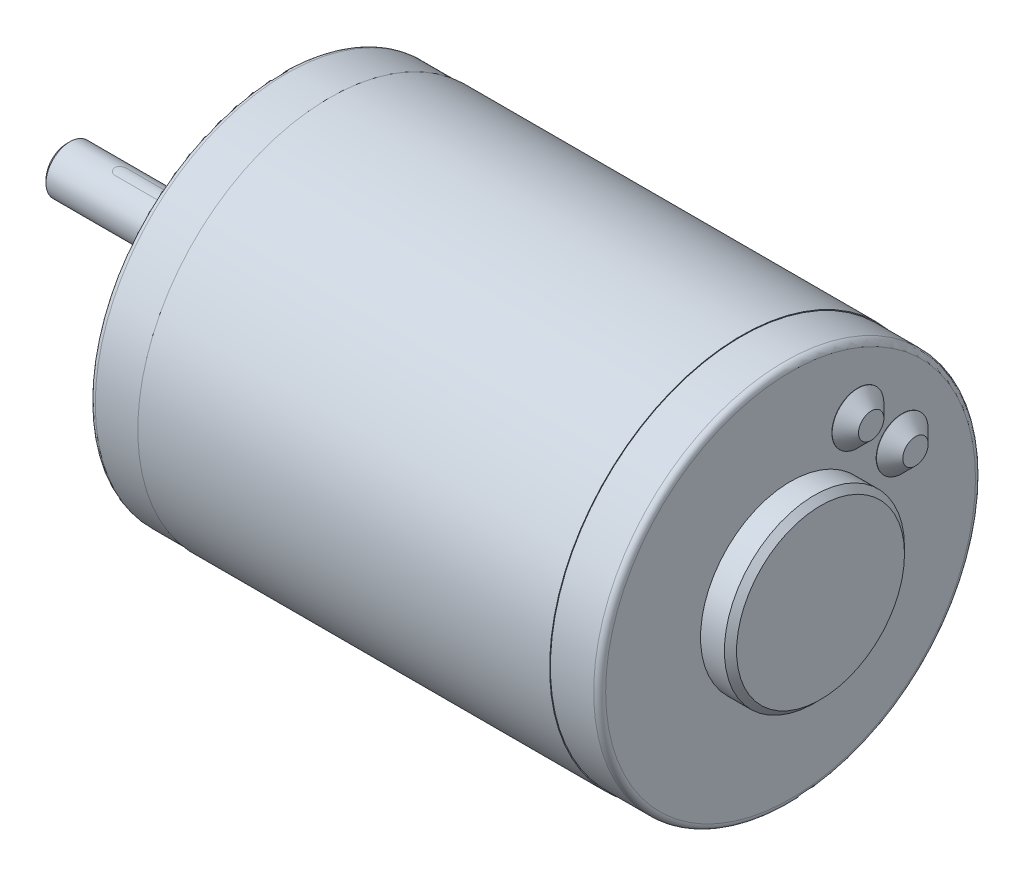
ISO-10303-21;
HEADER;
FILE_DESCRIPTION(('STEP AP214'),'2;1');
FILE_NAME('part.step','',(''),(''),'','','');
FILE_SCHEMA(('AUTOMOTIVE_DESIGN { 1 0 10303 214 1 1 1 1 }'));
ENDSEC;
DATA;
#1=APPLICATION_CONTEXT('core data for automotive mechanical design processes');
#2=APPLICATION_PROTOCOL_DEFINITION('international standard','automotive_design',2000,#1);
#3=PRODUCT_CONTEXT('',#1,'mechanical');
#4=PRODUCT('Part','Part','',(#3));
#5=PRODUCT_RELATED_PRODUCT_CATEGORY('part','',(#4));
#6=PRODUCT_DEFINITION_FORMATION('','',#4);
#7=PRODUCT_DEFINITION_CONTEXT('part definition',#1,'design');
#8=PRODUCT_DEFINITION('design','',#6,#7);
#9=PRODUCT_DEFINITION_SHAPE('','',#8);
#10=(LENGTH_UNIT() NAMED_UNIT(*) SI_UNIT(.MILLI.,.METRE.));
#11=(NAMED_UNIT(*) PLANE_ANGLE_UNIT() SI_UNIT($,.RADIAN.));
#12=(NAMED_UNIT(*) SI_UNIT($,.STERADIAN.) SOLID_ANGLE_UNIT());
#13=UNCERTAINTY_MEASURE_WITH_UNIT(LENGTH_MEASURE(1.E-05),#10,'distance_accuracy_value','');
#14=(GEOMETRIC_REPRESENTATION_CONTEXT(3) GLOBAL_UNCERTAINTY_ASSIGNED_CONTEXT((#13)) GLOBAL_UNIT_ASSIGNED_CONTEXT((#10,
#11,#12)) REPRESENTATION_CONTEXT('',''));
#15=CARTESIAN_POINT('',(0.,0.,0.));
#16=DIRECTION('',(0.,0.,1.));
#17=DIRECTION('',(1.,0.,0.));
#18=AXIS2_PLACEMENT_3D('',#15,#16,#17);
#19=CARTESIAN_POINT('',(-4.,0.,0.));
#20=DIRECTION('',(-1.,0.,0.));
#21=DIRECTION('',(0.,0.,1.));
#22=AXIS2_PLACEMENT_3D('',#19,#20,#21);
#23=PLANE('',#22);
#24=CARTESIAN_POINT('',(-4.,0.,0.));
#25=DIRECTION('',(-1.,0.,0.));
#26=DIRECTION('',(0.,0.,1.));
#27=AXIS2_PLACEMENT_3D('',#24,#25,#26);
#28=CIRCLE('',#27,8.50900000000003);
#29=CARTESIAN_POINT('',(-4.,0.,8.50900000000003));
#30=VERTEX_POINT('',#29);
#31=EDGE_CURVE('P0_E190',#30,#30,#28,.T.);
#32=ORIENTED_EDGE('',*,*,#31,.T.);
#33=EDGE_LOOP('',(#32));
#34=FACE_BOUND('',#33,.T.);
#35=CARTESIAN_POINT('',(-4.,0.,0.));
#36=DIRECTION('',(-1.,0.,0.));
#37=DIRECTION('',(0.,0.,1.));
#38=AXIS2_PLACEMENT_3D('',#35,#36,#37);
#39=CIRCLE('',#38,4.);
#40=CARTESIAN_POINT('',(-4.,0.,4.));
#41=VERTEX_POINT('',#40);
#42=EDGE_CURVE('P0_E122',#41,#41,#39,.T.);
#43=ORIENTED_EDGE('',*,*,#42,.F.);
#44=EDGE_LOOP('',(#43));
#45=FACE_BOUND('',#44,.T.);
#46=ADVANCED_FACE('P0_F39',(#34,#45),#23,.T.);
#47=CARTESIAN_POINT('',(0.,0.,0.));
#48=DIRECTION('',(-1.,0.,0.));
#49=DIRECTION('',(0.,0.,1.));
#50=AXIS2_PLACEMENT_3D('',#47,#48,#49);
#51=PLANE('',#50);
#52=CARTESIAN_POINT('',(0.,0.,0.));
#53=DIRECTION('',(-1.,0.,0.));
#54=DIRECTION('',(0.,0.,1.));
#55=AXIS2_PLACEMENT_3D('',#52,#53,#54);
#56=CIRCLE('',#55,30.877);
#57=CARTESIAN_POINT('',(0.,0.,30.877));
#58=VERTEX_POINT('',#57);
#59=EDGE_CURVE('P0_E208',#58,#58,#56,.T.);
#60=ORIENTED_EDGE('',*,*,#59,.T.);
#61=EDGE_LOOP('',(#60));
#62=FACE_BOUND('',#61,.T.);
#63=CARTESIAN_POINT('',(0.,25.4,0.));
#64=DIRECTION('',(-1.,0.,0.));
#65=DIRECTION('',(0.,0.,1.));
#66=AXIS2_PLACEMENT_3D('',#63,#64,#65);
#67=CIRCLE('',#66,2.01929999999999);
#68=CARTESIAN_POINT('',(0.,25.4,2.01929999999999));
#69=VERTEX_POINT('',#68);
#70=EDGE_CURVE('P0_E96',#69,#69,#67,.T.);
#71=ORIENTED_EDGE('',*,*,#70,.F.);
#72=EDGE_LOOP('',(#71));
#73=FACE_BOUND('',#72,.T.);
#74=CARTESIAN_POINT('',(0.,-25.4,0.));
#75=DIRECTION('',(-1.,0.,0.));
#76=DIRECTION('',(0.,0.,1.));
#77=AXIS2_PLACEMENT_3D('',#74,#75,#76);
#78=CIRCLE('',#77,2.01929999999999);
#79=CARTESIAN_POINT('',(0.,-25.4,2.01929999999999));
#80=VERTEX_POINT('',#79);
#81=EDGE_CURVE('P0_E95',#80,#80,#78,.T.);
#82=ORIENTED_EDGE('',*,*,#81,.F.);
#83=EDGE_LOOP('',(#82));
#84=FACE_BOUND('',#83,.T.);
#85=CARTESIAN_POINT('',(0.,0.,0.));
#86=DIRECTION('',(-1.,0.,0.));
#87=DIRECTION('',(0.,0.,1.));
#88=AXIS2_PLACEMENT_3D('',#85,#86,#87);
#89=CIRCLE('',#88,9.525);
#90=CARTESIAN_POINT('',(0.,0.,9.525));
#91=VERTEX_POINT('',#90);
#92=EDGE_CURVE('P0_E166',#91,#91,#89,.T.);
#93=ORIENTED_EDGE('',*,*,#92,.F.);
#94=EDGE_LOOP('',(#93));
#95=FACE_BOUND('',#94,.T.);
#96=ADVANCED_FACE('P0_F229',(#62,#73,#84,#95),#51,.T.);
#97=CARTESIAN_POINT('',(8.2296,32.004,0.));
#98=DIRECTION('',(-1.,0.,0.));
#99=DIRECTION('',(0.,0.,1.));
#100=AXIS2_PLACEMENT_3D('',#97,#98,#99);
#101=PLANE('',#100);
#102=CARTESIAN_POINT('',(8.2296,0.,0.));
#103=DIRECTION('',(1.,0.,0.));
#104=DIRECTION('',(0.,0.,-1.));
#105=AXIS2_PLACEMENT_3D('',#102,#103,#104);
#106=CIRCLE('',#105,32.004);
#107=CARTESIAN_POINT('',(8.2296,0.,-32.004));
#108=VERTEX_POINT('',#107);
#109=EDGE_CURVE('P0_E181',#108,#108,#106,.T.);
#110=ORIENTED_EDGE('',*,*,#109,.F.);
#111=EDGE_LOOP('',(#110));
#112=FACE_BOUND('',#111,.T.);
#113=CARTESIAN_POINT('',(8.2296,0.,0.));
#114=DIRECTION('',(-1.,0.,0.));
#115=DIRECTION('',(0.,0.,1.));
#116=AXIS2_PLACEMENT_3D('',#113,#114,#115);
#117=CIRCLE('',#116,31.877);
#118=CARTESIAN_POINT('',(8.2296,0.,31.877));
#119=VERTEX_POINT('',#118);
#120=EDGE_CURVE('P0_E169',#119,#119,#117,.T.);
#121=ORIENTED_EDGE('',*,*,#120,.F.);
#122=EDGE_LOOP('',(#121));
#123=FACE_BOUND('',#122,.T.);
#124=ADVANCED_FACE('P0_F235',(#112,#123),#101,.T.);
#125=CARTESIAN_POINT('',(85.216,0.,0.));
#126=DIRECTION('',(1.,0.,0.));
#127=DIRECTION('',(0.,0.,-1.));
#128=AXIS2_PLACEMENT_3D('',#125,#126,#127);
#129=PLANE('',#128);
#130=CARTESIAN_POINT('',(85.216,0.,0.));
#131=DIRECTION('',(1.,0.,0.));
#132=DIRECTION('',(0.,0.,-1.));
#133=AXIS2_PLACEMENT_3D('',#130,#131,#132);
#134=CIRCLE('',#133,30.877);
#135=CARTESIAN_POINT('',(85.216,0.,-30.877));
#136=VERTEX_POINT('',#135);
#137=EDGE_CURVE('P0_E47',#136,#136,#134,.T.);
#138=ORIENTED_EDGE('',*,*,#137,.T.);
#139=EDGE_LOOP('',(#138));
#140=FACE_BOUND('',#139,.T.);
#141=CARTESIAN_POINT('',(85.216,18.6070906828553,-11.2073596390943));
#142=DIRECTION('',(1.,0.,0.));
#143=DIRECTION('',(0.,0.,-1.));
#144=AXIS2_PLACEMENT_3D('',#141,#142,#143);
#145=CIRCLE('',#144,4.318);
#146=CARTESIAN_POINT('',(85.216,18.6070906828553,-15.5253596390943));
#147=VERTEX_POINT('',#146);
#148=EDGE_CURVE('P0_E187',#147,#147,#145,.T.);
#149=ORIENTED_EDGE('',*,*,#148,.F.);
#150=EDGE_LOOP('',(#149));
#151=FACE_BOUND('',#150,.T.);
#152=CARTESIAN_POINT('',(85.216,11.2073596390943,-18.6070906828553));
#153=DIRECTION('',(1.,0.,0.));
#154=DIRECTION('',(0.,0.,-1.));
#155=AXIS2_PLACEMENT_3D('',#152,#153,#154);
#156=CIRCLE('',#155,4.318);
#157=CARTESIAN_POINT('',(85.216,11.2073596390943,-22.9250906828553));
#158=VERTEX_POINT('',#157);
#159=EDGE_CURVE('P0_E184',#158,#158,#156,.T.);
#160=ORIENTED_EDGE('',*,*,#159,.F.);
#161=EDGE_LOOP('',(#160));
#162=FACE_BOUND('',#161,.T.);
#163=CARTESIAN_POINT('',(85.216,0.,0.));
#164=DIRECTION('',(1.,0.,0.));
#165=DIRECTION('',(0.,0.,-1.));
#166=AXIS2_PLACEMENT_3D('',#163,#164,#165);
#167=CIRCLE('',#166,15.0368);
#168=CARTESIAN_POINT('',(85.216,0.,-15.0368));
#169=VERTEX_POINT('',#168);
#170=EDGE_CURVE('P0_E172',#169,#169,#167,.T.);
#171=ORIENTED_EDGE('',*,*,#170,.F.);
#172=EDGE_LOOP('',(#171));
#173=FACE_BOUND('',#172,.T.);
#174=ADVANCED_FACE('P0_F216',(#140,#151,#162,#173),#129,.T.);
#175=CARTESIAN_POINT('',(76.9864,0.,0.));
#176=DIRECTION('',(1.,0.,0.));
#177=DIRECTION('',(0.,0.,-1.));
#178=AXIS2_PLACEMENT_3D('',#175,#176,#177);
#179=PLANE('',#178);
#180=CARTESIAN_POINT('',(76.9864,0.,0.));
#181=DIRECTION('',(1.,0.,0.));
#182=DIRECTION('',(0.,0.,-1.));
#183=AXIS2_PLACEMENT_3D('',#180,#181,#182);
#184=CIRCLE('',#183,32.004);
#185=CARTESIAN_POINT('',(76.9864,0.,-32.004));
#186=VERTEX_POINT('',#185);
#187=EDGE_CURVE('P0_E178',#186,#186,#184,.T.);
#188=ORIENTED_EDGE('',*,*,#187,.T.);
#189=EDGE_LOOP('',(#188));
#190=FACE_BOUND('',#189,.T.);
#191=CARTESIAN_POINT('',(76.9864,0.,0.));
#192=DIRECTION('',(1.,0.,0.));
#193=DIRECTION('',(0.,0.,-1.));
#194=AXIS2_PLACEMENT_3D('',#191,#192,#193);
#195=CIRCLE('',#194,31.877);
#196=CARTESIAN_POINT('',(76.9864,0.,-31.877));
#197=VERTEX_POINT('',#196);
#198=EDGE_CURVE('P0_E175',#197,#197,#195,.T.);
#199=ORIENTED_EDGE('',*,*,#198,.F.);
#200=EDGE_LOOP('',(#199));
#201=FACE_BOUND('',#200,.T.);
#202=ADVANCED_FACE('P0_F262',(#190,#201),#179,.T.);
#203=CARTESIAN_POINT('',(8.2296,0.,0.));
#204=DIRECTION('',(1.,0.,0.));
#205=DIRECTION('',(0.,0.,-1.));
#206=AXIS2_PLACEMENT_3D('',#203,#204,#205);
#207=CYLINDRICAL_SURFACE('',#206,32.004);
#208=ORIENTED_EDGE('',*,*,#109,.T.);
#209=EDGE_LOOP('',(#208));
#210=FACE_BOUND('',#209,.T.);
#211=ORIENTED_EDGE('',*,*,#187,.F.);
#212=EDGE_LOOP('',(#211));
#213=FACE_BOUND('',#212,.T.);
#214=ADVANCED_FACE('P0_F265',(#210,#213),#207,.T.);
#215=CARTESIAN_POINT('',(85.216,0.,0.));
#216=DIRECTION('',(-1.,0.,0.));
#217=DIRECTION('',(0.,0.,1.));
#218=AXIS2_PLACEMENT_3D('',#215,#216,#217);
#219=CYLINDRICAL_SURFACE('',#218,31.877);
#220=CARTESIAN_POINT('',(84.216,0.,0.));
#221=DIRECTION('',(1.,0.,0.));
#222=DIRECTION('',(0.,0.,-1.));
#223=AXIS2_PLACEMENT_3D('',#220,#221,#222);
#224=CIRCLE('',#223,31.877);
#225=CARTESIAN_POINT('',(84.216,0.,-31.877));
#226=VERTEX_POINT('',#225);
#227=EDGE_CURVE('P0_E11',#226,#226,#224,.F.);
#228=ORIENTED_EDGE('',*,*,#227,.T.);
#229=EDGE_LOOP('',(#228));
#230=FACE_BOUND('',#229,.T.);
#231=ORIENTED_EDGE('',*,*,#198,.T.);
#232=EDGE_LOOP('',(#231));
#233=FACE_BOUND('',#232,.T.);
#234=ADVANCED_FACE('P0_F258',(#230,#233),#219,.T.);
#235=CARTESIAN_POINT('',(90.216,0.,0.));
#236=DIRECTION('',(-1.,0.,0.));
#237=DIRECTION('',(0.,0.,1.));
#238=AXIS2_PLACEMENT_3D('',#235,#236,#237);
#239=CYLINDRICAL_SURFACE('',#238,15.0368);
#240=CARTESIAN_POINT('',(89.2,0.,0.));
#241=DIRECTION('',(1.,0.,0.));
#242=DIRECTION('',(0.,0.,-1.));
#243=AXIS2_PLACEMENT_3D('',#240,#241,#242);
#244=CIRCLE('',#243,15.0368);
#245=CARTESIAN_POINT('',(89.2,0.,-15.0368));
#246=VERTEX_POINT('',#245);
#247=EDGE_CURVE('P0_E199',#246,#246,#244,.F.);
#248=ORIENTED_EDGE('',*,*,#247,.T.);
#249=EDGE_LOOP('',(#248));
#250=FACE_BOUND('',#249,.T.);
#251=ORIENTED_EDGE('',*,*,#170,.T.);
#252=EDGE_LOOP('',(#251));
#253=FACE_BOUND('',#252,.T.);
#254=ADVANCED_FACE('P0_F254',(#250,#253),#239,.T.);
#255=CARTESIAN_POINT('',(90.216,0.,0.));
#256=DIRECTION('',(1.,0.,0.));
#257=DIRECTION('',(0.,0.,-1.));
#258=AXIS2_PLACEMENT_3D('',#255,#256,#257);
#259=PLANE('',#258);
#260=CARTESIAN_POINT('',(90.216,0.,0.));
#261=DIRECTION('',(1.,0.,0.));
#262=DIRECTION('',(0.,0.,-1.));
#263=AXIS2_PLACEMENT_3D('',#260,#261,#262);
#264=CIRCLE('',#263,14.0208);
#265=CARTESIAN_POINT('',(90.216,0.,-14.0208));
#266=VERTEX_POINT('',#265);
#267=EDGE_CURVE('P0_E196',#266,#266,#264,.T.);
#268=ORIENTED_EDGE('',*,*,#267,.T.);
#269=EDGE_LOOP('',(#268));
#270=FACE_BOUND('',#269,.T.);
#271=ADVANCED_FACE('P0_F250',(#270),#259,.T.);
#272=CARTESIAN_POINT('',(0.,0.,0.));
#273=DIRECTION('',(1.,0.,0.));
#274=DIRECTION('',(0.,0.,-1.));
#275=AXIS2_PLACEMENT_3D('',#272,#273,#274);
#276=CYLINDRICAL_SURFACE('',#275,31.877);
#277=CARTESIAN_POINT('',(0.999999999999997,0.,0.));
#278=DIRECTION('',(-1.,0.,0.));
#279=DIRECTION('',(0.,0.,1.));
#280=AXIS2_PLACEMENT_3D('',#277,#278,#279);
#281=CIRCLE('',#280,31.877);
#282=CARTESIAN_POINT('',(0.999999999999997,0.,31.877));
#283=VERTEX_POINT('',#282);
#284=EDGE_CURVE('P0_E211',#283,#283,#281,.F.);
#285=ORIENTED_EDGE('',*,*,#284,.T.);
#286=EDGE_LOOP('',(#285));
#287=FACE_BOUND('',#286,.T.);
#288=ORIENTED_EDGE('',*,*,#120,.T.);
#289=EDGE_LOOP('',(#288));
#290=FACE_BOUND('',#289,.T.);
#291=ADVANCED_FACE('P0_F245',(#287,#290),#276,.T.);
#292=CARTESIAN_POINT('',(-4.,0.,0.));
#293=DIRECTION('',(1.,0.,0.));
#294=DIRECTION('',(0.,0.,-1.));
#295=AXIS2_PLACEMENT_3D('',#292,#293,#294);
#296=CYLINDRICAL_SURFACE('',#295,9.525);
#297=CARTESIAN_POINT('',(-2.98400000000003,0.,0.));
#298=DIRECTION('',(-1.,0.,0.));
#299=DIRECTION('',(0.,0.,1.));
#300=AXIS2_PLACEMENT_3D('',#297,#298,#299);
#301=CIRCLE('',#300,9.525);
#302=CARTESIAN_POINT('',(-2.98400000000003,0.,9.525));
#303=VERTEX_POINT('',#302);
#304=EDGE_CURVE('P0_E193',#303,#303,#301,.F.);
#305=ORIENTED_EDGE('',*,*,#304,.T.);
#306=EDGE_LOOP('',(#305));
#307=FACE_BOUND('',#306,.T.);
#308=ORIENTED_EDGE('',*,*,#92,.T.);
#309=EDGE_LOOP('',(#308));
#310=FACE_BOUND('',#309,.T.);
#311=ADVANCED_FACE('P0_F243',(#307,#310),#296,.T.);
#312=CARTESIAN_POINT('',(-35.6,0.,0.));
#313=DIRECTION('',(1.,0.,0.));
#314=DIRECTION('',(0.,0.,-1.));
#315=AXIS2_PLACEMENT_3D('',#312,#313,#314);
#316=CYLINDRICAL_SURFACE('',#315,4.);
#317=CARTESIAN_POINT('',(-35.0999999999929,0.,0.));
#318=DIRECTION('',(-1.,0.,0.));
#319=DIRECTION('',(0.,0.,1.));
#320=AXIS2_PLACEMENT_3D('',#317,#318,#319);
#321=CIRCLE('',#320,4.);
#322=CARTESIAN_POINT('',(-35.0999999999929,0.,4.));
#323=VERTEX_POINT('',#322);
#324=EDGE_CURVE('P0_E205',#323,#323,#321,.F.);
#325=ORIENTED_EDGE('',*,*,#324,.T.);
#326=EDGE_LOOP('',(#325));
#327=FACE_BOUND('',#326,.T.);
#328=DIRECTION('',(1.,0.,0.));
#329=VECTOR('',#328,1.);
#330=CARTESIAN_POINT('',(0.,3.87298334620741,-1.));
#331=LINE('',#330,#329);
#332=CARTESIAN_POINT('',(-26.6,3.87298334620741,-1.));
#333=VERTEX_POINT('',#332);
#334=CARTESIAN_POINT('',(-7.1,3.87298334620741,-1.));
#335=VERTEX_POINT('',#334);
#336=EDGE_CURVE('P0_E141',#333,#335,#331,.T.);
#337=ORIENTED_EDGE('',*,*,#336,.T.);
#338=CARTESIAN_POINT('',(-7.1,3.87298334620741,-1.));
#339=CARTESIAN_POINT('',(-7.07233701489346,3.87298148580177,-1.00000033749611));
#340=CARTESIAN_POINT('',(-7.04468773698177,3.8732800994947,-0.998851407375366));
#341=CARTESIAN_POINT('',(-6.98959596469644,3.87445904774558,-0.994271295395754));
#342=CARTESIAN_POINT('',(-6.96215343631291,3.87533928441687,-0.990840497572679));
#343=CARTESIAN_POINT('',(-6.88054682679116,3.87881710972053,-0.977175239382526));
#344=CARTESIAN_POINT('',(-6.82694353151779,3.88225203148808,-0.963567695172493));
#345=CARTESIAN_POINT('',(-6.72287532621804,3.89095422588002,-0.927798076247997));
#346=CARTESIAN_POINT('',(-6.67241012178714,3.89622132630929,-0.905636805423836));
#347=CARTESIAN_POINT('',(-6.57588855135267,3.90799134471939,-0.853415378025865));
#348=CARTESIAN_POINT('',(-6.52983337210904,3.91449459395647,-0.823353103356933));
#349=CARTESIAN_POINT('',(-6.4424561180939,3.92816262398025,-0.755484471828069));
#350=CARTESIAN_POINT('',(-6.40124511375448,3.93533791028915,-0.717537268783976));
#351=CARTESIAN_POINT('',(-6.32569791051729,3.94945104396193,-0.63527578051623));
#352=CARTESIAN_POINT('',(-6.29136281053206,3.95638885322537,-0.590960479478831));
#353=CARTESIAN_POINT('',(-6.23008899838136,3.96936182283248,-0.496456899401691));
#354=CARTESIAN_POINT('',(-6.20326010401603,3.9753830468173,-0.446195340334474));
#355=CARTESIAN_POINT('',(-6.1584752658033,3.98572346250588,-0.341702590842919));
#356=CARTESIAN_POINT('',(-6.14051757570017,3.990042989147,-0.28747218408301));
#357=CARTESIAN_POINT('',(-6.11434100722257,3.99641900005128,-0.17774410852516));
#358=CARTESIAN_POINT('',(-6.10593232757718,3.998519529013,-0.122294322002858));
#359=CARTESIAN_POINT('',(-6.09849662845671,4.00037438150815,-0.0107327756816796));
#360=CARTESIAN_POINT('',(-6.09946842980766,4.00012899993444,0.0453789000287057));
#361=CARTESIAN_POINT('',(-6.11062996368545,3.99735237365735,0.155352492972096));
#362=CARTESIAN_POINT('',(-6.12061461659948,3.9948719867736,0.209236701739855));
#363=CARTESIAN_POINT('',(-6.14918867918275,3.98796330636495,0.31453871108434));
#364=CARTESIAN_POINT('',(-6.16777846956858,3.98353492665556,0.365956402423988));
#365=CARTESIAN_POINT('',(-6.21320128067065,3.97314997761798,0.465407286024539));
#366=CARTESIAN_POINT('',(-6.24010739423284,3.96717993827555,0.513405629602248));
#367=CARTESIAN_POINT('',(-6.30134312983347,3.95435945541919,0.604276631230014));
#368=CARTESIAN_POINT('',(-6.33567387025322,3.94750887933198,0.647148515562289));
#369=CARTESIAN_POINT('',(-6.41187891208131,3.93345566022865,0.72776938970849));
#370=CARTESIAN_POINT('',(-6.45393163653981,3.92624850477685,0.765349103054127));
#371=CARTESIAN_POINT('',(-6.54382986692773,3.91246168284006,0.832969575186237));
#372=CARTESIAN_POINT('',(-6.59167695328356,3.90588218842993,0.863008270245062));
#373=CARTESIAN_POINT('',(-6.69214559782377,3.89407813586325,0.914804709285962));
#374=CARTESIAN_POINT('',(-6.74479146489609,3.88886106009136,0.936517017887269));
#375=CARTESIAN_POINT('',(-6.85311692841829,3.88047058807055,0.970702351849829));
#376=CARTESIAN_POINT('',(-6.90879185514984,3.87729413761435,0.983189189212132));
#377=CARTESIAN_POINT('',(-6.9874573807589,3.87455290681524,0.993904635150938));
#378=CARTESIAN_POINT('',(-7.00991970321318,3.87396523110859,0.996190790966708));
#379=CARTESIAN_POINT('',(-7.05491778990932,3.87318062488974,0.999236757697394));
#380=CARTESIAN_POINT('',(-7.07745337595529,3.87298306219461,0.999999038096045));
#381=CARTESIAN_POINT('',(-7.1,3.87298334620741,1.));
#382=B_SPLINE_CURVE_WITH_KNOTS('',3,(#338,#339,#340,#341,#342,#343,#344,#345,#346,#347,#348,
#349,#350,#351,#352,#353,#354,#355,#356,#357,#358,#359,#360,#361,#362,#363,#364,#365,#366,#367,
#368,#369,#370,#371,#372,#373,#374,#375,#376,#377,#378,#379,#380,#381),.UNSPECIFIED.,.F.,.F.,(4,
2,2,2,2,2,2,2,2,2,2,2,2,2,2,2,2,2,2,2,2,4),(0.,0.0829365303397693,0.165859106084651,
0.331229963080317,0.496585282091498,0.661984974726749,0.830641897427974,0.999325753539193,
1.17036187098235,1.34136430732424,1.50890481515325,1.67642426256639,1.84022545479276,
2.00403389475838,2.16932509450376,2.33464120964329,2.50441429534542,2.67423379180967,
2.84496720161068,3.01544447539986,3.08315848722648,3.15076267731671),.UNSPECIFIED.);
#383=CARTESIAN_POINT('',(-7.1,3.87298334620741,1.));
#384=VERTEX_POINT('',#383);
#385=EDGE_CURVE('P0_E118',#335,#384,#382,.T.);
#386=ORIENTED_EDGE('',*,*,#385,.T.);
#387=DIRECTION('',(1.,0.,0.));
#388=VECTOR('',#387,1.);
#389=CARTESIAN_POINT('',(0.,3.87298334620741,1.));
#390=LINE('',#389,#388);
#391=CARTESIAN_POINT('',(-26.6,3.87298334620741,1.));
#392=VERTEX_POINT('',#391);
#393=EDGE_CURVE('P0_E156',#384,#392,#390,.F.);
#394=ORIENTED_EDGE('',*,*,#393,.T.);
#395=CARTESIAN_POINT('',(-26.6,3.87298334620741,1.));
#396=CARTESIAN_POINT('',(-26.6276629851065,3.87298148580177,1.00000033749611));
#397=CARTESIAN_POINT('',(-26.6553122630182,3.8732800994947,0.998851407375366));
#398=CARTESIAN_POINT('',(-26.7104040353036,3.87445904774558,0.994271295395754));
#399=CARTESIAN_POINT('',(-26.7378465636871,3.87533928441687,0.990840497572679));
#400=CARTESIAN_POINT('',(-26.8194531732088,3.87881710972053,0.977175239382526));
#401=CARTESIAN_POINT('',(-26.8730564684822,3.88225203148808,0.963567695172493));
#402=CARTESIAN_POINT('',(-26.977124673782,3.89095422588002,0.927798076247996));
#403=CARTESIAN_POINT('',(-27.0275898782129,3.89622132630929,0.905636805423835));
#404=CARTESIAN_POINT('',(-27.1241114486473,3.90799134471939,0.853415378025864));
#405=CARTESIAN_POINT('',(-27.170166627891,3.91449459395647,0.823353103356932));
#406=CARTESIAN_POINT('',(-27.2575438819061,3.92816262398025,0.755484471828069));
#407=CARTESIAN_POINT('',(-27.2987548862455,3.93533791028915,0.717537268783975));
#408=CARTESIAN_POINT('',(-27.3743020894827,3.94945104396193,0.635275780516229));
#409=CARTESIAN_POINT('',(-27.4086371894679,3.95638885322537,0.59096047947883));
#410=CARTESIAN_POINT('',(-27.4699110016186,3.96936182283248,0.496456899401689));
#411=CARTESIAN_POINT('',(-27.496739895984,3.9753830468173,0.446195340334472));
#412=CARTESIAN_POINT('',(-27.5415247341967,3.98572346250588,0.341702590842916));
#413=CARTESIAN_POINT('',(-27.5594824242998,3.990042989147,0.287472184083007));
#414=CARTESIAN_POINT('',(-27.5856589927774,3.99641900005128,0.177744108525158));
#415=CARTESIAN_POINT('',(-27.5940676724228,3.998519529013,0.122294322002856));
#416=CARTESIAN_POINT('',(-27.6015033715433,4.00037438150815,0.0107327756816781));
#417=CARTESIAN_POINT('',(-27.6005315701923,4.00012899993444,-0.0453789000287067));
#418=CARTESIAN_POINT('',(-27.5893700363146,3.99735237365735,-0.155352492972096));
#419=CARTESIAN_POINT('',(-27.5793853834005,3.9948719867736,-0.209236701739855));
#420=CARTESIAN_POINT('',(-27.5508113208173,3.98796330636495,-0.31453871108434));
#421=CARTESIAN_POINT('',(-27.5322215304314,3.98353492665556,-0.365956402423988));
#422=CARTESIAN_POINT('',(-27.4867987193294,3.97314997761798,-0.46540728602454));
#423=CARTESIAN_POINT('',(-27.4598926057672,3.96717993827555,-0.513405629602248));
#424=CARTESIAN_POINT('',(-27.3986568701665,3.95435945541919,-0.604276631230015));
#425=CARTESIAN_POINT('',(-27.3643261297468,3.94750887933198,-0.64714851556229));
#426=CARTESIAN_POINT('',(-27.2881210879187,3.93345566022865,-0.727769389708492));
#427=CARTESIAN_POINT('',(-27.2460683634602,3.92624850477685,-0.765349103054128));
#428=CARTESIAN_POINT('',(-27.1561701330723,3.91246168284006,-0.832969575186237));
#429=CARTESIAN_POINT('',(-27.1083230467164,3.90588218842993,-0.863008270245062));
#430=CARTESIAN_POINT('',(-27.0078544021762,3.89407813586325,-0.914804709285961));
#431=CARTESIAN_POINT('',(-26.9552085351039,3.88886106009136,-0.936517017887269));
#432=CARTESIAN_POINT('',(-26.8468830715817,3.88047058807054,-0.970702351849828));
#433=CARTESIAN_POINT('',(-26.7912081448502,3.87729413761435,-0.983189189212131));
#434=CARTESIAN_POINT('',(-26.7125426192411,3.87455290681524,-0.993904635150938));
#435=CARTESIAN_POINT('',(-26.6900802967868,3.87396523110859,-0.996190790966708));
#436=CARTESIAN_POINT('',(-26.6450822100907,3.87318062488974,-0.999236757697394));
#437=CARTESIAN_POINT('',(-26.6225466240447,3.87298306219461,-0.999999038096045));
#438=CARTESIAN_POINT('',(-26.6,3.87298334620741,-1.));
#439=B_SPLINE_CURVE_WITH_KNOTS('',3,(#395,#396,#397,#398,#399,#400,#401,#402,#403,#404,#405,
#406,#407,#408,#409,#410,#411,#412,#413,#414,#415,#416,#417,#418,#419,#420,#421,#422,#423,#424,
#425,#426,#427,#428,#429,#430,#431,#432,#433,#434,#435,#436,#437,#438),.UNSPECIFIED.,.F.,.F.,(4,
2,2,2,2,2,2,2,2,2,2,2,2,2,2,2,2,2,2,2,2,4),(0.,0.0829365303397727,0.165859106084653,
0.331229963080318,0.496585282091499,0.661984974726751,0.830641897427976,0.999325753539196,
1.17036187098235,1.34136430732425,1.50890481515325,1.67642426256639,1.84022545479276,
2.00403389475838,2.16932509450376,2.33464120964329,2.50441429534542,2.67423379180967,
2.84496720161068,3.01544447539986,3.08315848722649,3.15076267731671),.UNSPECIFIED.);
#440=EDGE_CURVE('P0_E54',#392,#333,#439,.T.);
#441=ORIENTED_EDGE('',*,*,#440,.T.);
#442=EDGE_LOOP('',(#337,#386,#394,#441));
#443=FACE_BOUND('',#442,.T.);
#444=ORIENTED_EDGE('',*,*,#42,.T.);
#445=EDGE_LOOP('',(#444));
#446=FACE_BOUND('',#445,.T.);
#447=ADVANCED_FACE('P0_F241',(#327,#443,#446),#316,.T.);
#448=CARTESIAN_POINT('',(-35.6,0.,0.));
#449=DIRECTION('',(-1.,0.,0.));
#450=DIRECTION('',(0.,0.,1.));
#451=AXIS2_PLACEMENT_3D('',#448,#449,#450);
#452=PLANE('',#451);
#453=CARTESIAN_POINT('',(-35.6,0.,0.));
#454=DIRECTION('',(-1.,0.,0.));
#455=DIRECTION('',(0.,0.,1.));
#456=AXIS2_PLACEMENT_3D('',#453,#454,#455);
#457=CIRCLE('',#456,3.4999999999361);
#458=CARTESIAN_POINT('',(-35.6,0.,3.4999999999361));
#459=VERTEX_POINT('',#458);
#460=EDGE_CURVE('P0_E202',#459,#459,#457,.T.);
#461=ORIENTED_EDGE('',*,*,#460,.T.);
#462=EDGE_LOOP('',(#461));
#463=FACE_BOUND('',#462,.T.);
#464=ADVANCED_FACE('P0_F292',(#463),#452,.T.);
#465=CARTESIAN_POINT('',(-7.1,32.005,0.));
#466=DIRECTION('',(0.,-1.,0.));
#467=DIRECTION('',(0.,0.,-1.));
#468=AXIS2_PLACEMENT_3D('',#465,#466,#467);
#469=CYLINDRICAL_SURFACE('',#468,1.);
#470=ORIENTED_EDGE('',*,*,#385,.F.);
#471=DIRECTION('',(0.,-1.,0.));
#472=VECTOR('',#471,1.);
#473=CARTESIAN_POINT('',(-7.1,32.005,-1.));
#474=LINE('',#473,#472);
#475=CARTESIAN_POINT('',(-7.1,2.79999999999999,-1.));
#476=VERTEX_POINT('',#475);
#477=EDGE_CURVE('P0_E140',#335,#476,#474,.T.);
#478=ORIENTED_EDGE('',*,*,#477,.T.);
#479=CARTESIAN_POINT('',(-7.1,2.79999999999999,0.));
#480=DIRECTION('',(0.,-1.,0.));
#481=DIRECTION('',(0.,0.,-1.));
#482=AXIS2_PLACEMENT_3D('',#479,#480,#481);
#483=CIRCLE('',#482,1.);
#484=CARTESIAN_POINT('',(-7.1,2.79999999999999,1.));
#485=VERTEX_POINT('',#484);
#486=EDGE_CURVE('P0_E129',#476,#485,#483,.T.);
#487=ORIENTED_EDGE('',*,*,#486,.T.);
#488=DIRECTION('',(0.,-1.,0.));
#489=VECTOR('',#488,1.);
#490=CARTESIAN_POINT('',(-7.1,32.005,1.));
#491=LINE('',#490,#489);
#492=EDGE_CURVE('P0_E62',#384,#485,#491,.T.);
#493=ORIENTED_EDGE('',*,*,#492,.F.);
#494=EDGE_LOOP('',(#470,#478,#487,#493));
#495=FACE_BOUND('',#494,.T.);
#496=ADVANCED_FACE('P0_F294',(#495),#469,.F.);
#497=CARTESIAN_POINT('',(-26.6,32.005,-1.));
#498=DIRECTION('',(0.,0.,-1.));
#499=DIRECTION('',(-1.,0.,0.));
#500=AXIS2_PLACEMENT_3D('',#497,#498,#499);
#501=PLANE('',#500);
#502=ORIENTED_EDGE('',*,*,#336,.F.);
#503=DIRECTION('',(0.,-1.,0.));
#504=VECTOR('',#503,1.);
#505=CARTESIAN_POINT('',(-26.6,32.005,-1.));
#506=LINE('',#505,#504);
#507=CARTESIAN_POINT('',(-26.6,2.79999999999999,-1.));
#508=VERTEX_POINT('',#507);
#509=EDGE_CURVE('P0_E139',#333,#508,#506,.T.);
#510=ORIENTED_EDGE('',*,*,#509,.T.);
#511=DIRECTION('',(1.,0.,0.));
#512=VECTOR('',#511,1.);
#513=CARTESIAN_POINT('',(-26.6,2.79999999999999,-1.));
#514=LINE('',#513,#512);
#515=EDGE_CURVE('P0_E119',#508,#476,#514,.T.);
#516=ORIENTED_EDGE('',*,*,#515,.T.);
#517=ORIENTED_EDGE('',*,*,#477,.F.);
#518=EDGE_LOOP('',(#502,#510,#516,#517));
#519=FACE_BOUND('',#518,.T.);
#520=ADVANCED_FACE('P0_F299',(#519),#501,.F.);
#521=CARTESIAN_POINT('',(-26.6,32.005,0.));
#522=DIRECTION('',(0.,-1.,0.));
#523=DIRECTION('',(0.,0.,-1.));
#524=AXIS2_PLACEMENT_3D('',#521,#522,#523);
#525=CYLINDRICAL_SURFACE('',#524,1.);
#526=ORIENTED_EDGE('',*,*,#440,.F.);
#527=DIRECTION('',(0.,-1.,0.));
#528=VECTOR('',#527,1.);
#529=CARTESIAN_POINT('',(-26.6,32.005,1.));
#530=LINE('',#529,#528);
#531=CARTESIAN_POINT('',(-26.6,2.79999999999999,1.));
#532=VERTEX_POINT('',#531);
#533=EDGE_CURVE('P0_E131',#392,#532,#530,.T.);
#534=ORIENTED_EDGE('',*,*,#533,.T.);
#535=CARTESIAN_POINT('',(-26.6,2.79999999999999,0.));
#536=DIRECTION('',(0.,-1.,0.));
#537=DIRECTION('',(0.,0.,-1.));
#538=AXIS2_PLACEMENT_3D('',#535,#536,#537);
#539=CIRCLE('',#538,1.);
#540=EDGE_CURVE('P0_E123',#532,#508,#539,.T.);
#541=ORIENTED_EDGE('',*,*,#540,.T.);
#542=ORIENTED_EDGE('',*,*,#509,.F.);
#543=EDGE_LOOP('',(#526,#534,#541,#542));
#544=FACE_BOUND('',#543,.T.);
#545=ADVANCED_FACE('P0_F305',(#544),#525,.F.);
#546=CARTESIAN_POINT('',(-7.1,32.005,1.));
#547=DIRECTION('',(0.,0.,1.));
#548=DIRECTION('',(1.,0.,0.));
#549=AXIS2_PLACEMENT_3D('',#546,#547,#548);
#550=PLANE('',#549);
#551=ORIENTED_EDGE('',*,*,#393,.F.);
#552=ORIENTED_EDGE('',*,*,#492,.T.);
#553=DIRECTION('',(-1.,0.,0.));
#554=VECTOR('',#553,1.);
#555=CARTESIAN_POINT('',(-7.1,2.79999999999999,1.));
#556=LINE('',#555,#554);
#557=EDGE_CURVE('P0_E126',#485,#532,#556,.T.);
#558=ORIENTED_EDGE('',*,*,#557,.T.);
#559=ORIENTED_EDGE('',*,*,#533,.F.);
#560=EDGE_LOOP('',(#551,#552,#558,#559));
#561=FACE_BOUND('',#560,.T.);
#562=ADVANCED_FACE('P0_F308',(#561),#550,.F.);
#563=CARTESIAN_POINT('',(-7.1,2.79999999999999,0.));
#564=DIRECTION('',(0.,-1.,0.));
#565=DIRECTION('',(0.,0.,-1.));
#566=AXIS2_PLACEMENT_3D('',#563,#564,#565);
#567=PLANE('',#566);
#568=ORIENTED_EDGE('',*,*,#486,.F.);
#569=ORIENTED_EDGE('',*,*,#515,.F.);
#570=ORIENTED_EDGE('',*,*,#540,.F.);
#571=ORIENTED_EDGE('',*,*,#557,.F.);
#572=EDGE_LOOP('',(#568,#569,#570,#571));
#573=FACE_BOUND('',#572,.T.);
#574=ADVANCED_FACE('P0_F310',(#573),#567,.F.);
#575=CARTESIAN_POINT('',(85.216,11.2073596390943,-18.6070906828553));
#576=DIRECTION('',(1.,0.,0.));
#577=DIRECTION('',(0.,0.,-1.));
#578=AXIS2_PLACEMENT_3D('',#575,#576,#577);
#579=CYLINDRICAL_SURFACE('',#578,4.318);
#580=ORIENTED_EDGE('',*,*,#159,.T.);
#581=EDGE_LOOP('',(#580));
#582=FACE_BOUND('',#581,.T.);
#583=CARTESIAN_POINT('',(85.2639,11.2073596390943,-18.6070906828553));
#584=DIRECTION('',(1.,0.,0.));
#585=DIRECTION('',(0.,0.,-1.));
#586=AXIS2_PLACEMENT_3D('',#583,#584,#585);
#587=CIRCLE('',#586,4.318);
#588=CARTESIAN_POINT('',(85.2639,11.2073596390943,-22.9250906828553));
#589=VERTEX_POINT('',#588);
#590=EDGE_CURVE('P0_E112',#589,#589,#587,.T.);
#591=ORIENTED_EDGE('',*,*,#590,.F.);
#592=EDGE_LOOP('',(#591));
#593=FACE_BOUND('',#592,.T.);
#594=ADVANCED_FACE('P0_F315',(#582,#593),#579,.T.);
#595=CARTESIAN_POINT('',(87.4638999999649,11.2073596390943,-18.6070906828553));
#596=DIRECTION('',(1.,0.,0.));
#597=DIRECTION('',(0.,0.,-1.));
#598=AXIS2_PLACEMENT_3D('',#595,#596,#597);
#599=PLANE('',#598);
#600=CARTESIAN_POINT('',(87.4638999999649,11.2073596390943,-18.6070906828553));
#601=DIRECTION('',(1.,0.,0.));
#602=DIRECTION('',(0.,0.,-1.));
#603=AXIS2_PLACEMENT_3D('',#600,#601,#602);
#604=CIRCLE('',#603,2.11800000003506);
#605=CARTESIAN_POINT('',(87.4638999999649,11.2073596390943,-20.7250906828904));
#606=VERTEX_POINT('',#605);
#607=EDGE_CURVE('P0_E115',#606,#606,#604,.T.);
#608=ORIENTED_EDGE('',*,*,#607,.T.);
#609=EDGE_LOOP('',(#608));
#610=FACE_BOUND('',#609,.T.);
#611=ADVANCED_FACE('P0_F338',(#610),#599,.T.);
#612=CARTESIAN_POINT('',(87.4638999999649,11.2073596390943,-18.6070906828553));
#613=DIRECTION('',(-1.,0.,0.));
#614=DIRECTION('',(0.,0.,1.));
#615=AXIS2_PLACEMENT_3D('',#612,#613,#614);
#616=CONICAL_SURFACE('',#615,2.11800000003506,0.78539816339745);
#617=ORIENTED_EDGE('',*,*,#590,.T.);
#618=EDGE_LOOP('',(#617));
#619=FACE_BOUND('',#618,.T.);
#620=ORIENTED_EDGE('',*,*,#607,.F.);
#621=EDGE_LOOP('',(#620));
#622=FACE_BOUND('',#621,.T.);
#623=ADVANCED_FACE('P0_F344',(#619,#622),#616,.T.);
#624=CARTESIAN_POINT('',(85.216,18.6070906828553,-11.2073596390943));
#625=DIRECTION('',(1.,0.,0.));
#626=DIRECTION('',(0.,0.,-1.));
#627=AXIS2_PLACEMENT_3D('',#624,#625,#626);
#628=CYLINDRICAL_SURFACE('',#627,4.318);
#629=ORIENTED_EDGE('',*,*,#148,.T.);
#630=EDGE_LOOP('',(#629));
#631=FACE_BOUND('',#630,.T.);
#632=CARTESIAN_POINT('',(85.2639,18.6070906828553,-11.2073596390943));
#633=DIRECTION('',(1.,0.,0.));
#634=DIRECTION('',(0.,0.,-1.));
#635=AXIS2_PLACEMENT_3D('',#632,#633,#634);
#636=CIRCLE('',#635,4.318);
#637=CARTESIAN_POINT('',(85.2639,18.6070906828553,-15.5253596390943));
#638=VERTEX_POINT('',#637);
#639=EDGE_CURVE('P0_E106',#638,#638,#636,.T.);
#640=ORIENTED_EDGE('',*,*,#639,.F.);
#641=EDGE_LOOP('',(#640));
#642=FACE_BOUND('',#641,.T.);
#643=ADVANCED_FACE('P0_F348',(#631,#642),#628,.T.);
#644=CARTESIAN_POINT('',(87.4638999999503,18.6070906828553,-11.2073596390943));
#645=DIRECTION('',(1.,0.,0.));
#646=DIRECTION('',(0.,0.,-1.));
#647=AXIS2_PLACEMENT_3D('',#644,#645,#646);
#648=PLANE('',#647);
#649=CARTESIAN_POINT('',(87.4638999999503,18.6070906828553,-11.2073596390943));
#650=DIRECTION('',(1.,0.,0.));
#651=DIRECTION('',(0.,0.,-1.));
#652=AXIS2_PLACEMENT_3D('',#649,#650,#651);
#653=CIRCLE('',#652,2.11800000004973);
#654=CARTESIAN_POINT('',(87.4638999999503,18.6070906828553,-13.3253596391441));
#655=VERTEX_POINT('',#654);
#656=EDGE_CURVE('P0_E109',#655,#655,#653,.T.);
#657=ORIENTED_EDGE('',*,*,#656,.T.);
#658=EDGE_LOOP('',(#657));
#659=FACE_BOUND('',#658,.T.);
#660=ADVANCED_FACE('P0_F352',(#659),#648,.T.);
#661=CARTESIAN_POINT('',(87.4638999999503,18.6070906828553,-11.2073596390943));
#662=DIRECTION('',(-1.,0.,0.));
#663=DIRECTION('',(0.,0.,1.));
#664=AXIS2_PLACEMENT_3D('',#661,#662,#663);
#665=CONICAL_SURFACE('',#664,2.11800000004973,0.785398163397448);
#666=ORIENTED_EDGE('',*,*,#639,.T.);
#667=EDGE_LOOP('',(#666));
#668=FACE_BOUND('',#667,.T.);
#669=ORIENTED_EDGE('',*,*,#656,.F.);
#670=EDGE_LOOP('',(#669));
#671=FACE_BOUND('',#670,.T.);
#672=ADVANCED_FACE('P0_F356',(#668,#671),#665,.T.);
#673=CARTESIAN_POINT('',(13.6144,-25.4,0.));
#674=DIRECTION('',(-1.,0.,0.));
#675=DIRECTION('',(0.,0.,1.));
#676=AXIS2_PLACEMENT_3D('',#673,#674,#675);
#677=CONICAL_SURFACE('',#676,2.01929999999999,1.02974425867198);
#678=CARTESIAN_POINT('',(14.8277178480152,-25.4,0.));
#679=VERTEX_POINT('',#678);
#680=VERTEX_LOOP('',#679);
#681=FACE_BOUND('',#680,.T.);
#682=CARTESIAN_POINT('',(13.6144,-25.4,0.));
#683=DIRECTION('',(-1.,0.,0.));
#684=DIRECTION('',(0.,0.,1.));
#685=AXIS2_PLACEMENT_3D('',#682,#683,#684);
#686=CIRCLE('',#685,2.01929999999999);
#687=CARTESIAN_POINT('',(13.6144,-25.4,2.01929999999999));
#688=VERTEX_POINT('',#687);
#689=EDGE_CURVE('P0_E99',#688,#688,#686,.T.);
#690=ORIENTED_EDGE('',*,*,#689,.T.);
#691=EDGE_LOOP('',(#690));
#692=FACE_BOUND('',#691,.T.);
#693=ADVANCED_FACE('P0_F360',(#681,#692),#677,.F.);
#694=CARTESIAN_POINT('',(0.,-25.4,0.));
#695=DIRECTION('',(-1.,0.,0.));
#696=DIRECTION('',(0.,0.,1.));
#697=AXIS2_PLACEMENT_3D('',#694,#695,#696);
#698=CYLINDRICAL_SURFACE('',#697,2.01929999999999);
#699=ORIENTED_EDGE('',*,*,#689,.F.);
#700=EDGE_LOOP('',(#699));
#701=FACE_BOUND('',#700,.T.);
#702=ORIENTED_EDGE('',*,*,#81,.T.);
#703=EDGE_LOOP('',(#702));
#704=FACE_BOUND('',#703,.T.);
#705=ADVANCED_FACE('P0_F89',(#701,#704),#698,.F.);
#706=CARTESIAN_POINT('',(13.6144,25.4,0.));
#707=DIRECTION('',(-1.,0.,0.));
#708=DIRECTION('',(0.,0.,1.));
#709=AXIS2_PLACEMENT_3D('',#706,#707,#708);
#710=CONICAL_SURFACE('',#709,2.01929999999999,1.02974425867198);
#711=CARTESIAN_POINT('',(14.8277178480152,25.4,0.));
#712=VERTEX_POINT('',#711);
#713=VERTEX_LOOP('',#712);
#714=FACE_BOUND('',#713,.T.);
#715=CARTESIAN_POINT('',(13.6144,25.4,0.));
#716=DIRECTION('',(-1.,0.,0.));
#717=DIRECTION('',(0.,0.,1.));
#718=AXIS2_PLACEMENT_3D('',#715,#716,#717);
#719=CIRCLE('',#718,2.01929999999999);
#720=CARTESIAN_POINT('',(13.6144,25.4,2.01929999999999));
#721=VERTEX_POINT('',#720);
#722=EDGE_CURVE('P0_E93',#721,#721,#719,.T.);
#723=ORIENTED_EDGE('',*,*,#722,.T.);
#724=EDGE_LOOP('',(#723));
#725=FACE_BOUND('',#724,.T.);
#726=ADVANCED_FACE('P0_F85',(#714,#725),#710,.F.);
#727=CARTESIAN_POINT('',(0.,25.4,0.));
#728=DIRECTION('',(-1.,0.,0.));
#729=DIRECTION('',(0.,0.,1.));
#730=AXIS2_PLACEMENT_3D('',#727,#728,#729);
#731=CYLINDRICAL_SURFACE('',#730,2.01929999999999);
#732=ORIENTED_EDGE('',*,*,#722,.F.);
#733=EDGE_LOOP('',(#732));
#734=FACE_BOUND('',#733,.T.);
#735=ORIENTED_EDGE('',*,*,#70,.T.);
#736=EDGE_LOOP('',(#735));
#737=FACE_BOUND('',#736,.T.);
#738=ADVANCED_FACE('P0_F88',(#734,#737),#731,.F.);
#739=CARTESIAN_POINT('',(-4.,0.,0.));
#740=DIRECTION('',(1.,0.,0.));
#741=DIRECTION('',(0.,0.,-1.));
#742=AXIS2_PLACEMENT_3D('',#739,#740,#741);
#743=CONICAL_SURFACE('',#742,8.50900000000003,0.785398163397447);
#744=ORIENTED_EDGE('',*,*,#304,.F.);
#745=EDGE_LOOP('',(#744));
#746=FACE_BOUND('',#745,.T.);
#747=ORIENTED_EDGE('',*,*,#31,.F.);
#748=EDGE_LOOP('',(#747));
#749=FACE_BOUND('',#748,.T.);
#750=ADVANCED_FACE('P0_F276',(#746,#749),#743,.T.);
#751=CARTESIAN_POINT('',(90.216,0.,0.));
#752=DIRECTION('',(-1.,0.,0.));
#753=DIRECTION('',(0.,0.,1.));
#754=AXIS2_PLACEMENT_3D('',#751,#752,#753);
#755=CONICAL_SURFACE('',#754,14.0208,0.785398163397447);
#756=ORIENTED_EDGE('',*,*,#247,.F.);
#757=EDGE_LOOP('',(#756));
#758=FACE_BOUND('',#757,.T.);
#759=ORIENTED_EDGE('',*,*,#267,.F.);
#760=EDGE_LOOP('',(#759));
#761=FACE_BOUND('',#760,.T.);
#762=ADVANCED_FACE('P0_F279',(#758,#761),#755,.T.);
#763=CARTESIAN_POINT('',(-35.6,0.,0.));
#764=DIRECTION('',(1.,0.,0.));
#765=DIRECTION('',(0.,0.,-1.));
#766=AXIS2_PLACEMENT_3D('',#763,#764,#765);
#767=CONICAL_SURFACE('',#766,3.4999999999361,0.785398163454291);
#768=ORIENTED_EDGE('',*,*,#324,.F.);
#769=EDGE_LOOP('',(#768));
#770=FACE_BOUND('',#769,.T.);
#771=ORIENTED_EDGE('',*,*,#460,.F.);
#772=EDGE_LOOP('',(#771));
#773=FACE_BOUND('',#772,.T.);
#774=ADVANCED_FACE('P0_F225',(#770,#773),#767,.T.);
#775=CARTESIAN_POINT('',(0.999999999999997,0.,0.));
#776=DIRECTION('',(-1.,0.,0.));
#777=DIRECTION('',(0.,0.,1.));
#778=AXIS2_PLACEMENT_3D('',#775,#776,#777);
#779=TOROIDAL_SURFACE('',#778,30.877,0.999999999999999);
#780=ORIENTED_EDGE('',*,*,#284,.F.);
#781=EDGE_LOOP('',(#780));
#782=FACE_BOUND('',#781,.T.);
#783=ORIENTED_EDGE('',*,*,#59,.F.);
#784=EDGE_LOOP('',(#783));
#785=FACE_BOUND('',#784,.T.);
#786=ADVANCED_FACE('P0_F220',(#782,#785),#779,.T.);
#787=CARTESIAN_POINT('',(84.216,0.,0.));
#788=DIRECTION('',(1.,0.,0.));
#789=DIRECTION('',(0.,0.,-1.));
#790=AXIS2_PLACEMENT_3D('',#787,#788,#789);
#791=TOROIDAL_SURFACE('',#790,30.877,0.999999999999999);
#792=ORIENTED_EDGE('',*,*,#227,.F.);
#793=EDGE_LOOP('',(#792));
#794=FACE_BOUND('',#793,.T.);
#795=ORIENTED_EDGE('',*,*,#137,.F.);
#796=EDGE_LOOP('',(#795));
#797=FACE_BOUND('',#796,.T.);
#798=ADVANCED_FACE('P0_F41',(#794,#797),#791,.T.);
#799=CLOSED_SHELL('',(#46,#96,#124,#174,#202,#214,#234,#254,#271,#291,#311,#447,#464,#496,#520,
#545,#562,#574,#594,#611,#623,#643,#660,#672,#693,#705,#726,#738,#750,#762,#774,#786,#798));
#800=MANIFOLD_SOLID_BREP('P0_B2',#799);
#801=CARTESIAN_POINT('',(0.,0.,0.));
#802=DIRECTION('',(1.,0.,0.));
#803=DIRECTION('',(0.,0.,-1.));
#804=AXIS2_PLACEMENT_3D('',#801,#802,#803);
#805=CYLINDRICAL_SURFACE('',#804,4.);
#806=DIRECTION('',(1.,0.,0.));
#807=VECTOR('',#806,1.);
#808=CARTESIAN_POINT('',(0.,3.87298334620741,1.));
#809=LINE('',#808,#807);
#810=CARTESIAN_POINT('',(-7.1,3.87298334620741,1.));
#811=VERTEX_POINT('',#810);
#812=CARTESIAN_POINT('',(-26.6,3.87298334620741,1.));
#813=VERTEX_POINT('',#812);
#814=EDGE_CURVE('P1_E31',#811,#813,#809,.F.);
#815=ORIENTED_EDGE('',*,*,#814,.F.);
#816=CARTESIAN_POINT('',(-7.1,3.87298334620741,-1.));
#817=CARTESIAN_POINT('',(-7.07233701489346,3.87298148580177,-1.00000033749611));
#818=CARTESIAN_POINT('',(-7.04468773698177,3.8732800994947,-0.998851407375366));
#819=CARTESIAN_POINT('',(-6.98959596469644,3.87445904774558,-0.994271295395754));
#820=CARTESIAN_POINT('',(-6.96215343631291,3.87533928441687,-0.990840497572679));
#821=CARTESIAN_POINT('',(-6.88054682679116,3.87881710972053,-0.977175239382526));
#822=CARTESIAN_POINT('',(-6.82694353151779,3.88225203148808,-0.963567695172493));
#823=CARTESIAN_POINT('',(-6.72287532621804,3.89095422588002,-0.927798076247997));
#824=CARTESIAN_POINT('',(-6.67241012178714,3.89622132630929,-0.905636805423836));
#825=CARTESIAN_POINT('',(-6.57588855135267,3.90799134471939,-0.853415378025865));
#826=CARTESIAN_POINT('',(-6.52983337210904,3.91449459395647,-0.823353103356933));
#827=CARTESIAN_POINT('',(-6.4424561180939,3.92816262398025,-0.755484471828069));
#828=CARTESIAN_POINT('',(-6.40124511375448,3.93533791028915,-0.717537268783976));
#829=CARTESIAN_POINT('',(-6.32569791051729,3.94945104396193,-0.63527578051623));
#830=CARTESIAN_POINT('',(-6.29136281053206,3.95638885322537,-0.590960479478831));
#831=CARTESIAN_POINT('',(-6.23008899838136,3.96936182283248,-0.496456899401691));
#832=CARTESIAN_POINT('',(-6.20326010401603,3.9753830468173,-0.446195340334474));
#833=CARTESIAN_POINT('',(-6.1584752658033,3.98572346250588,-0.341702590842919));
#834=CARTESIAN_POINT('',(-6.14051757570017,3.990042989147,-0.28747218408301));
#835=CARTESIAN_POINT('',(-6.11434100722257,3.99641900005128,-0.17774410852516));
#836=CARTESIAN_POINT('',(-6.10593232757718,3.998519529013,-0.122294322002858));
#837=CARTESIAN_POINT('',(-6.09849662845671,4.00037438150815,-0.0107327756816796));
#838=CARTESIAN_POINT('',(-6.09946842980766,4.00012899993444,0.0453789000287057));
#839=CARTESIAN_POINT('',(-6.11062996368545,3.99735237365735,0.155352492972096));
#840=CARTESIAN_POINT('',(-6.12061461659948,3.9948719867736,0.209236701739855));
#841=CARTESIAN_POINT('',(-6.14918867918275,3.98796330636495,0.31453871108434));
#842=CARTESIAN_POINT('',(-6.16777846956858,3.98353492665556,0.365956402423988));
#843=CARTESIAN_POINT('',(-6.21320128067065,3.97314997761798,0.465407286024539));
#844=CARTESIAN_POINT('',(-6.24010739423284,3.96717993827555,0.513405629602248));
#845=CARTESIAN_POINT('',(-6.30134312983347,3.95435945541919,0.604276631230014));
#846=CARTESIAN_POINT('',(-6.33567387025322,3.94750887933198,0.647148515562289));
#847=CARTESIAN_POINT('',(-6.41187891208131,3.93345566022865,0.72776938970849));
#848=CARTESIAN_POINT('',(-6.45393163653981,3.92624850477685,0.765349103054127));
#849=CARTESIAN_POINT('',(-6.54382986692773,3.91246168284006,0.832969575186237));
#850=CARTESIAN_POINT('',(-6.59167695328356,3.90588218842993,0.863008270245062));
#851=CARTESIAN_POINT('',(-6.69214559782377,3.89407813586325,0.914804709285962));
#852=CARTESIAN_POINT('',(-6.74479146489609,3.88886106009136,0.936517017887269));
#853=CARTESIAN_POINT('',(-6.85311692841829,3.88047058807055,0.970702351849829));
#854=CARTESIAN_POINT('',(-6.90879185514984,3.87729413761435,0.983189189212132));
#855=CARTESIAN_POINT('',(-6.9874573807589,3.87455290681524,0.993904635150938));
#856=CARTESIAN_POINT('',(-7.00991970321318,3.87396523110859,0.996190790966708));
#857=CARTESIAN_POINT('',(-7.05491778990932,3.87318062488974,0.999236757697394));
#858=CARTESIAN_POINT('',(-7.07745337595529,3.87298306219461,0.999999038096045));
#859=CARTESIAN_POINT('',(-7.1,3.87298334620741,1.));
#860=B_SPLINE_CURVE_WITH_KNOTS('',3,(#816,#817,#818,#819,#820,#821,#822,#823,#824,#825,#826,
#827,#828,#829,#830,#831,#832,#833,#834,#835,#836,#837,#838,#839,#840,#841,#842,#843,#844,#845,
#846,#847,#848,#849,#850,#851,#852,#853,#854,#855,#856,#857,#858,#859),.UNSPECIFIED.,.F.,.F.,(4,
2,2,2,2,2,2,2,2,2,2,2,2,2,2,2,2,2,2,2,2,4),(0.,0.0829365303397693,0.165859106084651,
0.331229963080317,0.496585282091498,0.661984974726749,0.830641897427974,0.999325753539193,
1.17036187098235,1.34136430732424,1.50890481515325,1.67642426256639,1.84022545479276,
2.00403389475838,2.16932509450376,2.33464120964329,2.50441429534542,2.67423379180967,
2.84496720161068,3.01544447539986,3.08315848722648,3.15076267731671),.UNSPECIFIED.);
#861=CARTESIAN_POINT('',(-7.1,3.87298334620741,-1.));
#862=VERTEX_POINT('',#861);
#863=EDGE_CURVE('P1_E42',#862,#811,#860,.T.);
#864=ORIENTED_EDGE('',*,*,#863,.F.);
#865=DIRECTION('',(1.,0.,0.));
#866=VECTOR('',#865,1.);
#867=CARTESIAN_POINT('',(0.,3.87298334620741,-1.));
#868=LINE('',#867,#866);
#869=CARTESIAN_POINT('',(-26.6,3.87298334620741,-1.));
#870=VERTEX_POINT('',#869);
#871=EDGE_CURVE('P1_E27',#870,#862,#868,.T.);
#872=ORIENTED_EDGE('',*,*,#871,.F.);
#873=CARTESIAN_POINT('',(-26.6,3.87298334620741,1.));
#874=CARTESIAN_POINT('',(-26.6276629851065,3.87298148580177,1.00000033749611));
#875=CARTESIAN_POINT('',(-26.6553122630182,3.8732800994947,0.998851407375366));
#876=CARTESIAN_POINT('',(-26.7104040353036,3.87445904774558,0.994271295395754));
#877=CARTESIAN_POINT('',(-26.7378465636871,3.87533928441687,0.990840497572679));
#878=CARTESIAN_POINT('',(-26.8194531732088,3.87881710972053,0.977175239382526));
#879=CARTESIAN_POINT('',(-26.8730564684822,3.88225203148808,0.963567695172493));
#880=CARTESIAN_POINT('',(-26.977124673782,3.89095422588002,0.927798076247996));
#881=CARTESIAN_POINT('',(-27.0275898782129,3.89622132630929,0.905636805423835));
#882=CARTESIAN_POINT('',(-27.1241114486473,3.90799134471939,0.853415378025864));
#883=CARTESIAN_POINT('',(-27.170166627891,3.91449459395647,0.823353103356932));
#884=CARTESIAN_POINT('',(-27.2575438819061,3.92816262398025,0.755484471828069));
#885=CARTESIAN_POINT('',(-27.2987548862455,3.93533791028915,0.717537268783975));
#886=CARTESIAN_POINT('',(-27.3743020894827,3.94945104396193,0.635275780516229));
#887=CARTESIAN_POINT('',(-27.4086371894679,3.95638885322537,0.59096047947883));
#888=CARTESIAN_POINT('',(-27.4699110016186,3.96936182283248,0.496456899401689));
#889=CARTESIAN_POINT('',(-27.496739895984,3.9753830468173,0.446195340334472));
#890=CARTESIAN_POINT('',(-27.5415247341967,3.98572346250588,0.341702590842916));
#891=CARTESIAN_POINT('',(-27.5594824242998,3.990042989147,0.287472184083007));
#892=CARTESIAN_POINT('',(-27.5856589927774,3.99641900005128,0.177744108525158));
#893=CARTESIAN_POINT('',(-27.5940676724228,3.998519529013,0.122294322002856));
#894=CARTESIAN_POINT('',(-27.6015033715433,4.00037438150815,0.0107327756816781));
#895=CARTESIAN_POINT('',(-27.6005315701923,4.00012899993444,-0.0453789000287067));
#896=CARTESIAN_POINT('',(-27.5893700363146,3.99735237365735,-0.155352492972096));
#897=CARTESIAN_POINT('',(-27.5793853834005,3.9948719867736,-0.209236701739855));
#898=CARTESIAN_POINT('',(-27.5508113208173,3.98796330636495,-0.31453871108434));
#899=CARTESIAN_POINT('',(-27.5322215304314,3.98353492665556,-0.365956402423988));
#900=CARTESIAN_POINT('',(-27.4867987193294,3.97314997761798,-0.46540728602454));
#901=CARTESIAN_POINT('',(-27.4598926057672,3.96717993827555,-0.513405629602248));
#902=CARTESIAN_POINT('',(-27.3986568701665,3.95435945541919,-0.604276631230015));
#903=CARTESIAN_POINT('',(-27.3643261297468,3.94750887933198,-0.64714851556229));
#904=CARTESIAN_POINT('',(-27.2881210879187,3.93345566022865,-0.727769389708492));
#905=CARTESIAN_POINT('',(-27.2460683634602,3.92624850477685,-0.765349103054128));
#906=CARTESIAN_POINT('',(-27.1561701330723,3.91246168284006,-0.832969575186237));
#907=CARTESIAN_POINT('',(-27.1083230467164,3.90588218842993,-0.863008270245062));
#908=CARTESIAN_POINT('',(-27.0078544021762,3.89407813586325,-0.914804709285961));
#909=CARTESIAN_POINT('',(-26.9552085351039,3.88886106009136,-0.936517017887269));
#910=CARTESIAN_POINT('',(-26.8468830715817,3.88047058807054,-0.970702351849828));
#911=CARTESIAN_POINT('',(-26.7912081448502,3.87729413761435,-0.983189189212131));
#912=CARTESIAN_POINT('',(-26.7125426192411,3.87455290681524,-0.993904635150938));
#913=CARTESIAN_POINT('',(-26.6900802967868,3.87396523110859,-0.996190790966708));
#914=CARTESIAN_POINT('',(-26.6450822100907,3.87318062488974,-0.999236757697394));
#915=CARTESIAN_POINT('',(-26.6225466240447,3.87298306219461,-0.999999038096045));
#916=CARTESIAN_POINT('',(-26.6,3.87298334620741,-1.));
#917=B_SPLINE_CURVE_WITH_KNOTS('',3,(#873,#874,#875,#876,#877,#878,#879,#880,#881,#882,#883,
#884,#885,#886,#887,#888,#889,#890,#891,#892,#893,#894,#895,#896,#897,#898,#899,#900,#901,#902,
#903,#904,#905,#906,#907,#908,#909,#910,#911,#912,#913,#914,#915,#916),.UNSPECIFIED.,.F.,.F.,(4,
2,2,2,2,2,2,2,2,2,2,2,2,2,2,2,2,2,2,2,2,4),(0.,0.0829365303397727,0.165859106084653,
0.331229963080318,0.496585282091499,0.661984974726751,0.830641897427976,0.999325753539196,
1.17036187098235,1.34136430732425,1.50890481515325,1.67642426256639,1.84022545479276,
2.00403389475838,2.16932509450376,2.33464120964329,2.50441429534542,2.67423379180967,
2.84496720161068,3.01544447539986,3.08315848722649,3.15076267731671),.UNSPECIFIED.);
#918=EDGE_CURVE('P1_E11',#813,#870,#917,.T.);
#919=ORIENTED_EDGE('',*,*,#918,.F.);
#920=EDGE_LOOP('',(#815,#864,#872,#919));
#921=FACE_BOUND('',#920,.T.);
#922=ADVANCED_FACE('P1_F17',(#921),#805,.T.);
#923=OPEN_SHELL('',(#922));
#924=SHELL_BASED_SURFACE_MODEL('P1_B1',(#923));
#925=ADVANCED_BREP_SHAPE_REPRESENTATION('',(#18,#800),#14);
#926=MANIFOLD_SURFACE_SHAPE_REPRESENTATION('',(#18,#924),#14);
#927=SHAPE_REPRESENTATION('',(#18),#14);
#928=SHAPE_DEFINITION_REPRESENTATION(#9,#927);
#929=SHAPE_REPRESENTATION_RELATIONSHIP('','',#927,#925);
#930=SHAPE_REPRESENTATION_RELATIONSHIP('','',#927,#926);
ENDSEC;
END-ISO-10303-21;
